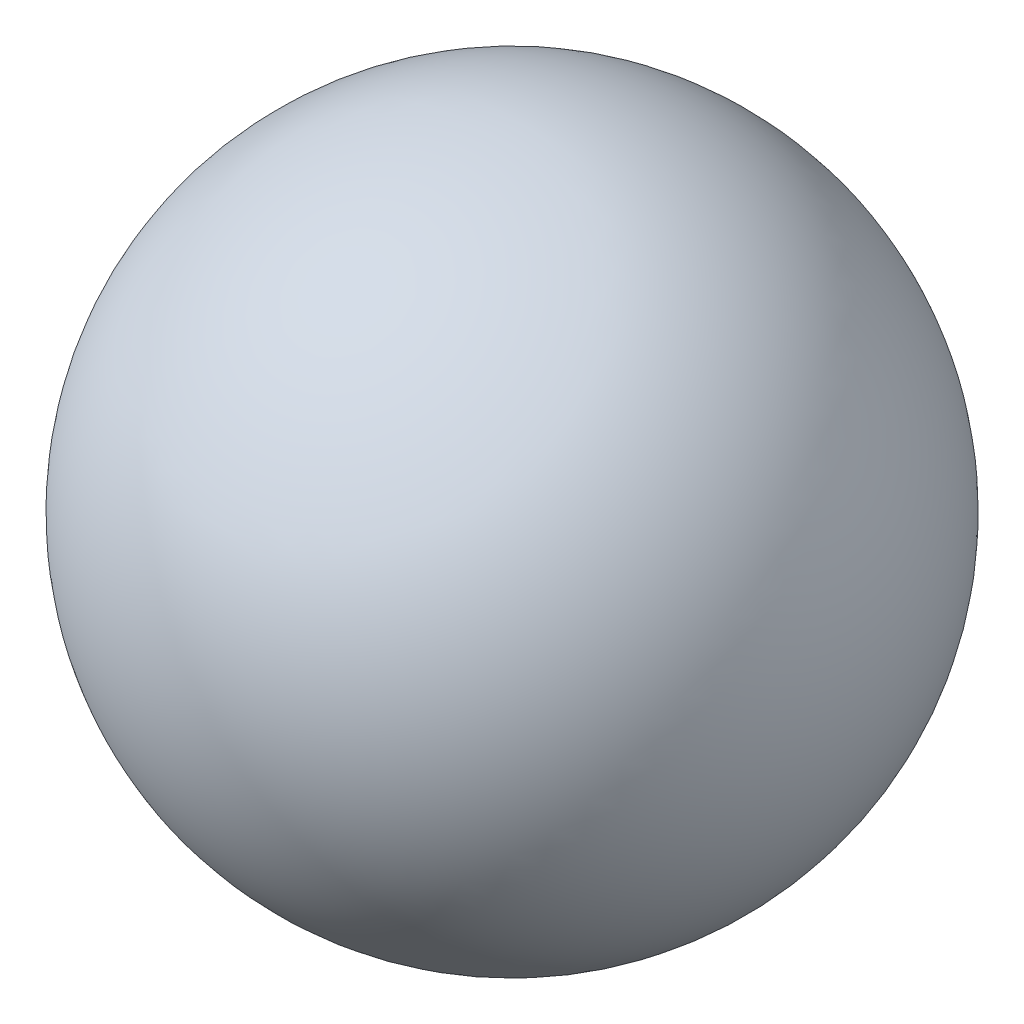
ISO-10303-21;
HEADER;
FILE_DESCRIPTION(('STEP AP214'),'2;1');
FILE_NAME('part.step','',(''),(''),'','','');
FILE_SCHEMA(('AUTOMOTIVE_DESIGN { 1 0 10303 214 1 1 1 1 }'));
ENDSEC;
DATA;
#1=APPLICATION_CONTEXT('core data for automotive mechanical design processes');
#2=APPLICATION_PROTOCOL_DEFINITION('international standard','automotive_design',2000,#1);
#3=PRODUCT_CONTEXT('',#1,'mechanical');
#4=PRODUCT('Part','Part','',(#3));
#5=PRODUCT_RELATED_PRODUCT_CATEGORY('part','',(#4));
#6=PRODUCT_DEFINITION_FORMATION('','',#4);
#7=PRODUCT_DEFINITION_CONTEXT('part definition',#1,'design');
#8=PRODUCT_DEFINITION('design','',#6,#7);
#9=PRODUCT_DEFINITION_SHAPE('','',#8);
#10=(LENGTH_UNIT() NAMED_UNIT(*) SI_UNIT(.MILLI.,.METRE.));
#11=(NAMED_UNIT(*) PLANE_ANGLE_UNIT() SI_UNIT($,.RADIAN.));
#12=(NAMED_UNIT(*) SI_UNIT($,.STERADIAN.) SOLID_ANGLE_UNIT());
#13=UNCERTAINTY_MEASURE_WITH_UNIT(LENGTH_MEASURE(1.E-05),#10,'distance_accuracy_value','');
#14=(GEOMETRIC_REPRESENTATION_CONTEXT(3) GLOBAL_UNCERTAINTY_ASSIGNED_CONTEXT((#13)) GLOBAL_UNIT_ASSIGNED_CONTEXT((#10,
#11,#12)) REPRESENTATION_CONTEXT('',''));
#15=CARTESIAN_POINT('',(0.,0.,0.));
#16=DIRECTION('',(0.,0.,1.));
#17=DIRECTION('',(1.,0.,0.));
#18=AXIS2_PLACEMENT_3D('',#15,#16,#17);
#19=CARTESIAN_POINT('',(0.,0.,-250.));
#20=DIRECTION('',(0.,0.,1.));
#21=DIRECTION('',(-1.,0.,0.));
#22=AXIS2_PLACEMENT_3D('',#19,#20,#21);
#23=SPHERICAL_SURFACE('',#22,250.);
#24=CARTESIAN_POINT('',(0.,0.,0.));
#25=VERTEX_POINT('',#24);
#26=VERTEX_LOOP('',#25);
#27=FACE_BOUND('',#26,.T.);
#28=ADVANCED_FACE('F26',(#27),#23,.T.);
#29=CLOSED_SHELL('',(#28));
#30=MANIFOLD_SOLID_BREP('B2',#29);
#31=ADVANCED_BREP_SHAPE_REPRESENTATION('',(#18,#30),#14);
#32=SHAPE_DEFINITION_REPRESENTATION(#9,#31);
ENDSEC;
END-ISO-10303-21;
